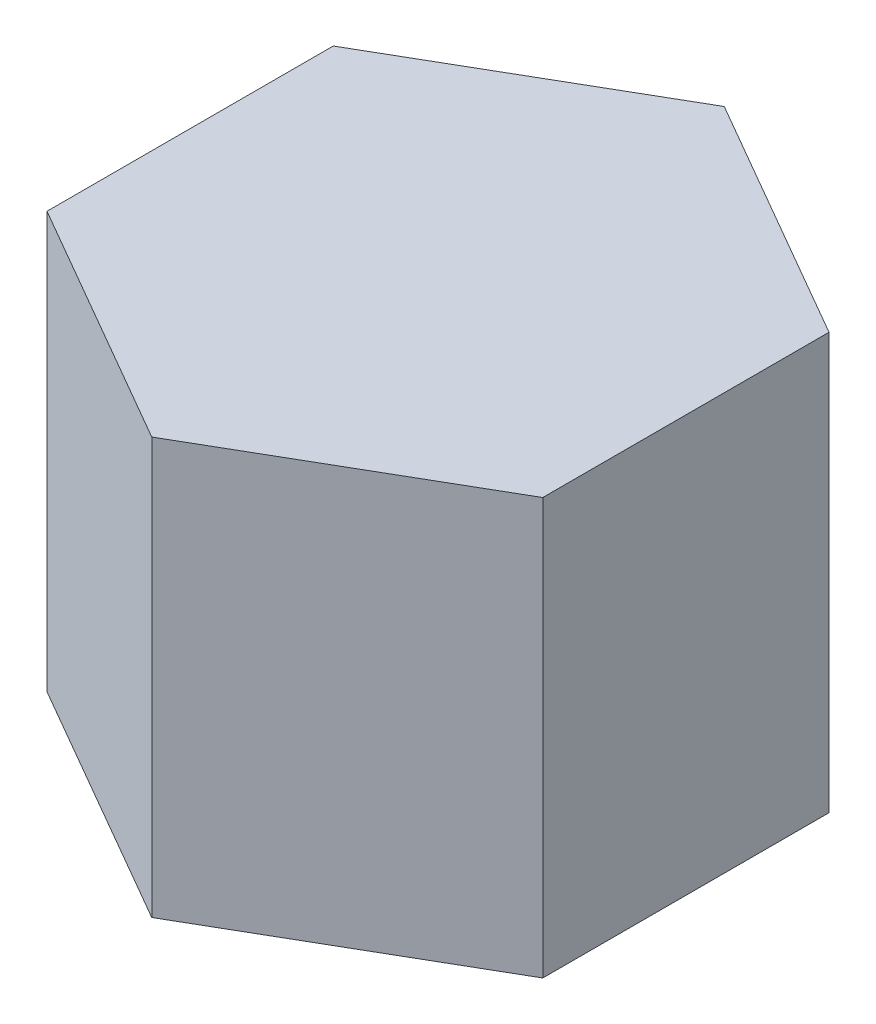
ISO-10303-21;
HEADER;
FILE_DESCRIPTION(('STEP AP214'),'2;1');
FILE_NAME('part.step','',(''),(''),'','','');
FILE_SCHEMA(('AUTOMOTIVE_DESIGN { 1 0 10303 214 1 1 1 1 }'));
ENDSEC;
DATA;
#1=APPLICATION_CONTEXT('core data for automotive mechanical design processes');
#2=APPLICATION_PROTOCOL_DEFINITION('international standard','automotive_design',2000,#1);
#3=PRODUCT_CONTEXT('',#1,'mechanical');
#4=PRODUCT('Part','Part','',(#3));
#5=PRODUCT_RELATED_PRODUCT_CATEGORY('part','',(#4));
#6=PRODUCT_DEFINITION_FORMATION('','',#4);
#7=PRODUCT_DEFINITION_CONTEXT('part definition',#1,'design');
#8=PRODUCT_DEFINITION('design','',#6,#7);
#9=PRODUCT_DEFINITION_SHAPE('','',#8);
#10=(LENGTH_UNIT() NAMED_UNIT(*) SI_UNIT(.MILLI.,.METRE.));
#11=(NAMED_UNIT(*) PLANE_ANGLE_UNIT() SI_UNIT($,.RADIAN.));
#12=(NAMED_UNIT(*) SI_UNIT($,.STERADIAN.) SOLID_ANGLE_UNIT());
#13=UNCERTAINTY_MEASURE_WITH_UNIT(LENGTH_MEASURE(1.E-05),#10,'distance_accuracy_value','');
#14=(GEOMETRIC_REPRESENTATION_CONTEXT(3) GLOBAL_UNCERTAINTY_ASSIGNED_CONTEXT((#13)) GLOBAL_UNIT_ASSIGNED_CONTEXT((#10,
#11,#12)) REPRESENTATION_CONTEXT('',''));
#15=CARTESIAN_POINT('',(0.,0.,0.));
#16=DIRECTION('',(0.,0.,1.));
#17=DIRECTION('',(1.,0.,0.));
#18=AXIS2_PLACEMENT_3D('',#15,#16,#17);
#19=CARTESIAN_POINT('',(205.339551417382,-147.556598747966,295.146072835632));
#20=DIRECTION('',(-0.500000000000096,0.,-0.866025403784383));
#21=DIRECTION('',(-0.866025403784383,0.,0.500000000000096));
#22=AXIS2_PLACEMENT_3D('',#19,#20,#21);
#23=PLANE('',#22);
#24=CARTESIAN_POINT('',(205.642660308706,-147.047793579175,294.971072835632));
#25=DIRECTION('',(-0.866025403784383,0.,0.500000000000096));
#26=VECTOR('',#25,1.);
#27=LINE('',#24,#26);
#28=CARTESIAN_POINT('',(205.642660308706,-147.047793579175,294.971072835632));
#29=VERTEX_POINT('',#28);
#30=CARTESIAN_POINT('',(205.339551417382,-147.047793579175,295.146072835632));
#31=VERTEX_POINT('',#30);
#32=EDGE_CURVE('E170',#29,#31,#27,.T.);
#33=ORIENTED_EDGE('',*,*,#32,.T.);
#34=CARTESIAN_POINT('',(205.339551417382,-147.556598747966,295.146072835632));
#35=DIRECTION('',(0.,1.,0.));
#36=VECTOR('',#35,1.);
#37=LINE('',#34,#36);
#38=CARTESIAN_POINT('',(205.339551417382,-147.556598747966,295.146072835632));
#39=VERTEX_POINT('',#38);
#40=EDGE_CURVE('E35',#39,#31,#37,.T.);
#41=ORIENTED_EDGE('',*,*,#40,.F.);
#42=CARTESIAN_POINT('',(205.642660308706,-147.556598747966,294.971072835632));
#43=DIRECTION('',(-0.866025403784383,0.,0.500000000000096));
#44=VECTOR('',#43,1.);
#45=LINE('',#42,#44);
#46=CARTESIAN_POINT('',(205.642660308706,-147.556598747966,294.971072835632));
#47=VERTEX_POINT('',#46);
#48=EDGE_CURVE('E159',#47,#39,#45,.T.);
#49=ORIENTED_EDGE('',*,*,#48,.F.);
#50=CARTESIAN_POINT('',(205.642660308706,-147.556598747966,294.971072835632));
#51=DIRECTION('',(0.,1.,0.));
#52=VECTOR('',#51,1.);
#53=LINE('',#50,#52);
#54=EDGE_CURVE('E10',#47,#29,#53,.T.);
#55=ORIENTED_EDGE('',*,*,#54,.T.);
#56=EDGE_LOOP('',(#33,#41,#49,#55));
#57=FACE_BOUND('',#56,.T.);
#58=ADVANCED_FACE('F16',(#57),#23,.F.);
#59=CARTESIAN_POINT('',(205.642660308706,-147.556598747966,291.594471220494));
#60=DIRECTION('',(-1.,0.,0.));
#61=DIRECTION('',(0.,-1.,0.));
#62=AXIS2_PLACEMENT_3D('',#59,#60,#61);
#63=PLANE('',#62);
#64=CARTESIAN_POINT('',(205.642660308706,-147.047793579175,294.621072835632));
#65=DIRECTION('',(0.,0.,1.));
#66=VECTOR('',#65,1.);
#67=LINE('',#64,#66);
#68=CARTESIAN_POINT('',(205.642660308706,-147.047793579175,294.621072835632));
#69=VERTEX_POINT('',#68);
#70=EDGE_CURVE('E167',#69,#29,#67,.T.);
#71=ORIENTED_EDGE('',*,*,#70,.T.);
#72=ORIENTED_EDGE('',*,*,#54,.F.);
#73=CARTESIAN_POINT('',(205.642660308706,-147.556598747966,294.621072835632));
#74=DIRECTION('',(0.,0.,1.));
#75=VECTOR('',#74,1.);
#76=LINE('',#73,#75);
#77=CARTESIAN_POINT('',(205.642660308706,-147.556598747966,294.621072835632));
#78=VERTEX_POINT('',#77);
#79=EDGE_CURVE('E156',#78,#47,#76,.T.);
#80=ORIENTED_EDGE('',*,*,#79,.F.);
#81=CARTESIAN_POINT('',(205.642660308706,-147.556598747966,294.621072835632));
#82=DIRECTION('',(0.,1.,0.));
#83=VECTOR('',#82,1.);
#84=LINE('',#81,#83);
#85=EDGE_CURVE('E27',#78,#69,#84,.T.);
#86=ORIENTED_EDGE('',*,*,#85,.T.);
#87=EDGE_LOOP('',(#71,#72,#80,#86));
#88=FACE_BOUND('',#87,.T.);
#89=ADVANCED_FACE('F189',(#88),#63,.F.);
#90=CARTESIAN_POINT('',(205.642660308706,-147.556598747966,294.621072835632));
#91=DIRECTION('',(-0.500000000000096,0.,0.866025403784383));
#92=DIRECTION('',(0.866025403784383,0.,0.500000000000096));
#93=AXIS2_PLACEMENT_3D('',#90,#91,#92);
#94=PLANE('',#93);
#95=CARTESIAN_POINT('',(205.339551417382,-147.047793579175,294.446072835632));
#96=DIRECTION('',(0.866025403784383,0.,0.500000000000096));
#97=VECTOR('',#96,1.);
#98=LINE('',#95,#97);
#99=CARTESIAN_POINT('',(205.339551417382,-147.047793579175,294.446072835632));
#100=VERTEX_POINT('',#99);
#101=EDGE_CURVE('E163',#100,#69,#98,.T.);
#102=ORIENTED_EDGE('',*,*,#101,.T.);
#103=ORIENTED_EDGE('',*,*,#85,.F.);
#104=CARTESIAN_POINT('',(205.339551417382,-147.556598747966,294.446072835632));
#105=DIRECTION('',(0.866025403784383,0.,0.500000000000096));
#106=VECTOR('',#105,1.);
#107=LINE('',#104,#106);
#108=CARTESIAN_POINT('',(205.339551417382,-147.556598747966,294.446072835632));
#109=VERTEX_POINT('',#108);
#110=EDGE_CURVE('E106',#109,#78,#107,.T.);
#111=ORIENTED_EDGE('',*,*,#110,.F.);
#112=CARTESIAN_POINT('',(205.339551417382,-147.556598747966,294.446072835632));
#113=DIRECTION('',(0.,1.,0.));
#114=VECTOR('',#113,1.);
#115=LINE('',#112,#114);
#116=EDGE_CURVE('E94',#109,#100,#115,.T.);
#117=ORIENTED_EDGE('',*,*,#116,.T.);
#118=EDGE_LOOP('',(#102,#103,#111,#117));
#119=FACE_BOUND('',#118,.T.);
#120=ADVANCED_FACE('F198',(#119),#94,.F.);
#121=CARTESIAN_POINT('',(205.339551417382,-147.556598747966,294.446072835632));
#122=DIRECTION('',(0.500000000000096,0.,0.866025403784383));
#123=DIRECTION('',(0.866025403784383,0.,-0.500000000000096));
#124=AXIS2_PLACEMENT_3D('',#121,#122,#123);
#125=PLANE('',#124);
#126=CARTESIAN_POINT('',(205.036442526057,-147.047793579175,294.621072835632));
#127=DIRECTION('',(0.866025403784383,0.,-0.500000000000096));
#128=VECTOR('',#127,1.);
#129=LINE('',#126,#128);
#130=CARTESIAN_POINT('',(205.036442526057,-147.047793579175,294.621072835632));
#131=VERTEX_POINT('',#130);
#132=EDGE_CURVE('E162',#131,#100,#129,.T.);
#133=ORIENTED_EDGE('',*,*,#132,.T.);
#134=ORIENTED_EDGE('',*,*,#116,.F.);
#135=CARTESIAN_POINT('',(205.036442526057,-147.556598747966,294.621072835632));
#136=DIRECTION('',(0.866025403784383,0.,-0.500000000000096));
#137=VECTOR('',#136,1.);
#138=LINE('',#135,#137);
#139=CARTESIAN_POINT('',(205.036442526057,-147.556598747966,294.621072835632));
#140=VERTEX_POINT('',#139);
#141=EDGE_CURVE('E98',#140,#109,#138,.T.);
#142=ORIENTED_EDGE('',*,*,#141,.F.);
#143=CARTESIAN_POINT('',(205.036442526057,-147.556598747966,294.621072835632));
#144=DIRECTION('',(0.,1.,0.));
#145=VECTOR('',#144,1.);
#146=LINE('',#143,#145);
#147=EDGE_CURVE('E79',#140,#131,#146,.T.);
#148=ORIENTED_EDGE('',*,*,#147,.T.);
#149=EDGE_LOOP('',(#133,#134,#142,#148));
#150=FACE_BOUND('',#149,.T.);
#151=ADVANCED_FACE('F100',(#150),#125,.F.);
#152=CARTESIAN_POINT('',(205.036442526057,-147.556598747966,291.594471220494));
#153=DIRECTION('',(1.,0.,0.));
#154=DIRECTION('',(0.,1.,0.));
#155=AXIS2_PLACEMENT_3D('',#152,#153,#154);
#156=PLANE('',#155);
#157=CARTESIAN_POINT('',(205.036442526057,-147.047793579175,294.971072835632));
#158=DIRECTION('',(0.,0.,-1.));
#159=VECTOR('',#158,1.);
#160=LINE('',#157,#159);
#161=CARTESIAN_POINT('',(205.036442526057,-147.047793579175,294.971072835632));
#162=VERTEX_POINT('',#161);
#163=EDGE_CURVE('E88',#162,#131,#160,.T.);
#164=ORIENTED_EDGE('',*,*,#163,.T.);
#165=ORIENTED_EDGE('',*,*,#147,.F.);
#166=CARTESIAN_POINT('',(205.036442526057,-147.556598747966,294.971072835632));
#167=DIRECTION('',(0.,0.,-1.));
#168=VECTOR('',#167,1.);
#169=LINE('',#166,#168);
#170=CARTESIAN_POINT('',(205.036442526057,-147.556598747966,294.971072835632));
#171=VERTEX_POINT('',#170);
#172=EDGE_CURVE('E84',#171,#140,#169,.T.);
#173=ORIENTED_EDGE('',*,*,#172,.F.);
#174=CARTESIAN_POINT('',(205.036442526057,-147.556598747966,294.971072835632));
#175=DIRECTION('',(0.,1.,0.));
#176=VECTOR('',#175,1.);
#177=LINE('',#174,#176);
#178=EDGE_CURVE('E58',#171,#162,#177,.T.);
#179=ORIENTED_EDGE('',*,*,#178,.T.);
#180=EDGE_LOOP('',(#164,#165,#173,#179));
#181=FACE_BOUND('',#180,.T.);
#182=ADVANCED_FACE('F82',(#181),#156,.F.);
#183=CARTESIAN_POINT('',(205.036442526057,-147.556598747966,294.971072835632));
#184=DIRECTION('',(0.500000000000062,0.,-0.866025403784403));
#185=DIRECTION('',(-0.866025403784403,0.,-0.500000000000062));
#186=AXIS2_PLACEMENT_3D('',#183,#184,#185);
#187=PLANE('',#186);
#188=CARTESIAN_POINT('',(205.339551417382,-147.047793579175,295.146072835632));
#189=DIRECTION('',(-0.866025403784403,0.,-0.500000000000062));
#190=VECTOR('',#189,1.);
#191=LINE('',#188,#190);
#192=EDGE_CURVE('E160',#31,#162,#191,.T.);
#193=ORIENTED_EDGE('',*,*,#192,.T.);
#194=ORIENTED_EDGE('',*,*,#178,.F.);
#195=CARTESIAN_POINT('',(205.339551417382,-147.556598747966,295.146072835632));
#196=DIRECTION('',(-0.866025403784403,0.,-0.500000000000062));
#197=VECTOR('',#196,1.);
#198=LINE('',#195,#197);
#199=EDGE_CURVE('E112',#39,#171,#198,.T.);
#200=ORIENTED_EDGE('',*,*,#199,.F.);
#201=ORIENTED_EDGE('',*,*,#40,.T.);
#202=EDGE_LOOP('',(#193,#194,#200,#201));
#203=FACE_BOUND('',#202,.T.);
#204=ADVANCED_FACE('F131',(#203),#187,.F.);
#205=CARTESIAN_POINT('',(206.491105863044,-147.556598747966,291.594471220494));
#206=DIRECTION('',(0.,1.,0.));
#207=DIRECTION('',(-1.,0.,0.));
#208=AXIS2_PLACEMENT_3D('',#205,#206,#207);
#209=PLANE('',#208);
#210=ORIENTED_EDGE('',*,*,#48,.T.);
#211=ORIENTED_EDGE('',*,*,#199,.T.);
#212=ORIENTED_EDGE('',*,*,#172,.T.);
#213=ORIENTED_EDGE('',*,*,#141,.T.);
#214=ORIENTED_EDGE('',*,*,#110,.T.);
#215=ORIENTED_EDGE('',*,*,#79,.T.);
#216=EDGE_LOOP('',(#210,#211,#212,#213,#214,#215));
#217=FACE_BOUND('',#216,.T.);
#218=ADVANCED_FACE('F111',(#217),#209,.F.);
#219=CARTESIAN_POINT('',(206.491105863044,-147.047793579175,291.594471220494));
#220=DIRECTION('',(0.,1.,0.));
#221=DIRECTION('',(-1.,0.,0.));
#222=AXIS2_PLACEMENT_3D('',#219,#220,#221);
#223=PLANE('',#222);
#224=ORIENTED_EDGE('',*,*,#32,.F.);
#225=ORIENTED_EDGE('',*,*,#70,.F.);
#226=ORIENTED_EDGE('',*,*,#101,.F.);
#227=ORIENTED_EDGE('',*,*,#132,.F.);
#228=ORIENTED_EDGE('',*,*,#163,.F.);
#229=ORIENTED_EDGE('',*,*,#192,.F.);
#230=EDGE_LOOP('',(#224,#225,#226,#227,#228,#229));
#231=FACE_BOUND('',#230,.T.);
#232=ADVANCED_FACE('F130',(#231),#223,.T.);
#233=CLOSED_SHELL('',(#58,#89,#120,#151,#182,#204,#218,#232));
#234=MANIFOLD_SOLID_BREP('B1',#233);
#235=ADVANCED_BREP_SHAPE_REPRESENTATION('',(#18,#234),#14);
#236=SHAPE_DEFINITION_REPRESENTATION(#9,#235);
ENDSEC;
END-ISO-10303-21;
